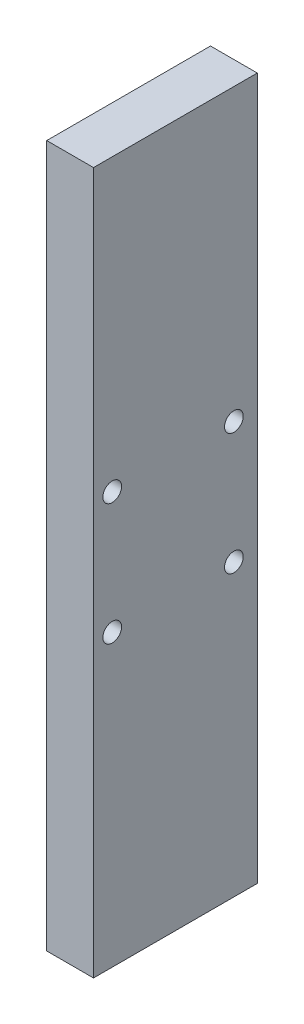
ISO-10303-21;
HEADER;
FILE_DESCRIPTION(('STEP AP214'),'2;1');
FILE_NAME('part.step','',(''),(''),'','','');
FILE_SCHEMA(('AUTOMOTIVE_DESIGN { 1 0 10303 214 1 1 1 1 }'));
ENDSEC;
DATA;
#1=APPLICATION_CONTEXT('core data for automotive mechanical design processes');
#2=APPLICATION_PROTOCOL_DEFINITION('international standard','automotive_design',2000,#1);
#3=PRODUCT_CONTEXT('',#1,'mechanical');
#4=PRODUCT('Part','Part','',(#3));
#5=PRODUCT_RELATED_PRODUCT_CATEGORY('part','',(#4));
#6=PRODUCT_DEFINITION_FORMATION('','',#4);
#7=PRODUCT_DEFINITION_CONTEXT('part definition',#1,'design');
#8=PRODUCT_DEFINITION('design','',#6,#7);
#9=PRODUCT_DEFINITION_SHAPE('','',#8);
#10=(LENGTH_UNIT() NAMED_UNIT(*) SI_UNIT(.MILLI.,.METRE.));
#11=(NAMED_UNIT(*) PLANE_ANGLE_UNIT() SI_UNIT($,.RADIAN.));
#12=(NAMED_UNIT(*) SI_UNIT($,.STERADIAN.) SOLID_ANGLE_UNIT());
#13=UNCERTAINTY_MEASURE_WITH_UNIT(LENGTH_MEASURE(1.E-05),#10,'distance_accuracy_value','');
#14=(GEOMETRIC_REPRESENTATION_CONTEXT(3) GLOBAL_UNCERTAINTY_ASSIGNED_CONTEXT((#13)) GLOBAL_UNIT_ASSIGNED_CONTEXT((#10,
#11,#12)) REPRESENTATION_CONTEXT('',''));
#15=CARTESIAN_POINT('',(0.,0.,0.));
#16=DIRECTION('',(0.,0.,1.));
#17=DIRECTION('',(1.,0.,0.));
#18=AXIS2_PLACEMENT_3D('',#15,#16,#17);
#19=CARTESIAN_POINT('',(10.,0.,0.));
#20=DIRECTION('',(0.,0.,-1.));
#21=DIRECTION('',(-1.,0.,0.));
#22=AXIS2_PLACEMENT_3D('',#19,#20,#21);
#23=PLANE('',#22);
#24=DIRECTION('',(0.,-1.,0.));
#25=VECTOR('',#24,1.);
#26=CARTESIAN_POINT('',(0.,0.,0.));
#27=LINE('',#26,#25);
#28=CARTESIAN_POINT('',(0.,150.,0.));
#29=VERTEX_POINT('',#28);
#30=CARTESIAN_POINT('',(0.,0.,0.));
#31=VERTEX_POINT('',#30);
#32=EDGE_CURVE('E182',#29,#31,#27,.T.);
#33=ORIENTED_EDGE('',*,*,#32,.T.);
#34=DIRECTION('',(-1.,0.,0.));
#35=VECTOR('',#34,1.);
#36=CARTESIAN_POINT('',(10.,0.,0.));
#37=LINE('',#36,#35);
#38=CARTESIAN_POINT('',(10.,0.,0.));
#39=VERTEX_POINT('',#38);
#40=EDGE_CURVE('E12',#39,#31,#37,.T.);
#41=ORIENTED_EDGE('',*,*,#40,.F.);
#42=DIRECTION('',(0.,-1.,0.));
#43=VECTOR('',#42,1.);
#44=CARTESIAN_POINT('',(10.,0.,0.));
#45=LINE('',#44,#43);
#46=CARTESIAN_POINT('',(10.,150.,0.));
#47=VERTEX_POINT('',#46);
#48=EDGE_CURVE('E102',#47,#39,#45,.T.);
#49=ORIENTED_EDGE('',*,*,#48,.F.);
#50=DIRECTION('',(-1.,0.,0.));
#51=VECTOR('',#50,1.);
#52=CARTESIAN_POINT('',(10.,150.,0.));
#53=LINE('',#52,#51);
#54=EDGE_CURVE('E115',#47,#29,#53,.T.);
#55=ORIENTED_EDGE('',*,*,#54,.T.);
#56=EDGE_LOOP('',(#33,#41,#49,#55));
#57=FACE_BOUND('',#56,.T.);
#58=ADVANCED_FACE('F49',(#57),#23,.F.);
#59=CARTESIAN_POINT('',(10.,0.,0.));
#60=DIRECTION('',(0.,1.,0.));
#61=DIRECTION('',(0.,0.,1.));
#62=AXIS2_PLACEMENT_3D('',#59,#60,#61);
#63=PLANE('',#62);
#64=DIRECTION('',(0.,0.,-1.));
#65=VECTOR('',#64,1.);
#66=CARTESIAN_POINT('',(0.,0.,0.));
#67=LINE('',#66,#65);
#68=CARTESIAN_POINT('',(0.,0.,-35.));
#69=VERTEX_POINT('',#68);
#70=EDGE_CURVE('E107',#31,#69,#67,.T.);
#71=ORIENTED_EDGE('',*,*,#70,.T.);
#72=DIRECTION('',(-1.,0.,0.));
#73=VECTOR('',#72,1.);
#74=CARTESIAN_POINT('',(10.,0.,-35.));
#75=LINE('',#74,#73);
#76=CARTESIAN_POINT('',(10.,0.,-35.));
#77=VERTEX_POINT('',#76);
#78=EDGE_CURVE('E59',#77,#69,#75,.T.);
#79=ORIENTED_EDGE('',*,*,#78,.F.);
#80=DIRECTION('',(0.,0.,-1.));
#81=VECTOR('',#80,1.);
#82=CARTESIAN_POINT('',(10.,0.,0.));
#83=LINE('',#82,#81);
#84=EDGE_CURVE('E97',#39,#77,#83,.T.);
#85=ORIENTED_EDGE('',*,*,#84,.F.);
#86=ORIENTED_EDGE('',*,*,#40,.T.);
#87=EDGE_LOOP('',(#71,#79,#85,#86));
#88=FACE_BOUND('',#87,.T.);
#89=ADVANCED_FACE('F106',(#88),#63,.F.);
#90=CARTESIAN_POINT('',(10.,0.,-35.));
#91=DIRECTION('',(0.,0.,1.));
#92=DIRECTION('',(1.,0.,0.));
#93=AXIS2_PLACEMENT_3D('',#90,#91,#92);
#94=PLANE('',#93);
#95=DIRECTION('',(0.,1.,0.));
#96=VECTOR('',#95,1.);
#97=CARTESIAN_POINT('',(0.,0.,-35.));
#98=LINE('',#97,#96);
#99=CARTESIAN_POINT('',(0.,150.,-35.));
#100=VERTEX_POINT('',#99);
#101=EDGE_CURVE('E84',#69,#100,#98,.T.);
#102=ORIENTED_EDGE('',*,*,#101,.T.);
#103=DIRECTION('',(-1.,0.,0.));
#104=VECTOR('',#103,1.);
#105=CARTESIAN_POINT('',(10.,150.,-35.));
#106=LINE('',#105,#104);
#107=CARTESIAN_POINT('',(10.,150.,-35.));
#108=VERTEX_POINT('',#107);
#109=EDGE_CURVE('E109',#108,#100,#106,.T.);
#110=ORIENTED_EDGE('',*,*,#109,.F.);
#111=DIRECTION('',(0.,1.,0.));
#112=VECTOR('',#111,1.);
#113=CARTESIAN_POINT('',(10.,0.,-35.));
#114=LINE('',#113,#112);
#115=EDGE_CURVE('E100',#77,#108,#114,.T.);
#116=ORIENTED_EDGE('',*,*,#115,.F.);
#117=ORIENTED_EDGE('',*,*,#78,.T.);
#118=EDGE_LOOP('',(#102,#110,#116,#117));
#119=FACE_BOUND('',#118,.T.);
#120=ADVANCED_FACE('F110',(#119),#94,.F.);
#121=CARTESIAN_POINT('',(10.,150.,0.));
#122=DIRECTION('',(0.,-1.,0.));
#123=DIRECTION('',(0.,0.,-1.));
#124=AXIS2_PLACEMENT_3D('',#121,#122,#123);
#125=PLANE('',#124);
#126=DIRECTION('',(0.,0.,1.));
#127=VECTOR('',#126,1.);
#128=CARTESIAN_POINT('',(0.,150.,0.));
#129=LINE('',#128,#127);
#130=EDGE_CURVE('E90',#100,#29,#129,.T.);
#131=ORIENTED_EDGE('',*,*,#130,.T.);
#132=ORIENTED_EDGE('',*,*,#54,.F.);
#133=DIRECTION('',(0.,0.,1.));
#134=VECTOR('',#133,1.);
#135=CARTESIAN_POINT('',(10.,150.,0.));
#136=LINE('',#135,#134);
#137=EDGE_CURVE('E67',#108,#47,#136,.T.);
#138=ORIENTED_EDGE('',*,*,#137,.F.);
#139=ORIENTED_EDGE('',*,*,#109,.T.);
#140=EDGE_LOOP('',(#131,#132,#138,#139));
#141=FACE_BOUND('',#140,.T.);
#142=ADVANCED_FACE('F238',(#141),#125,.F.);
#143=CARTESIAN_POINT('',(10.,0.,0.));
#144=DIRECTION('',(-1.,0.,0.));
#145=DIRECTION('',(0.,0.,1.));
#146=AXIS2_PLACEMENT_3D('',#143,#144,#145);
#147=PLANE('',#146);
#148=CARTESIAN_POINT('',(10.,62.,-4.00000000000001));
#149=DIRECTION('',(1.,0.,0.));
#150=DIRECTION('',(0.,0.,-1.));
#151=AXIS2_PLACEMENT_3D('',#148,#149,#150);
#152=CIRCLE('',#151,2.);
#153=CARTESIAN_POINT('',(10.,62.,-6.00000000000001));
#154=VERTEX_POINT('',#153);
#155=EDGE_CURVE('E170',#154,#154,#152,.T.);
#156=ORIENTED_EDGE('',*,*,#155,.F.);
#157=EDGE_LOOP('',(#156));
#158=FACE_BOUND('',#157,.T.);
#159=CARTESIAN_POINT('',(10.,62.,-30.));
#160=DIRECTION('',(1.,0.,0.));
#161=DIRECTION('',(0.,0.,-1.));
#162=AXIS2_PLACEMENT_3D('',#159,#160,#161);
#163=CIRCLE('',#162,2.);
#164=CARTESIAN_POINT('',(10.,62.,-32.));
#165=VERTEX_POINT('',#164);
#166=EDGE_CURVE('E211',#165,#165,#163,.T.);
#167=ORIENTED_EDGE('',*,*,#166,.F.);
#168=EDGE_LOOP('',(#167));
#169=FACE_BOUND('',#168,.T.);
#170=CARTESIAN_POINT('',(10.,88.,-30.));
#171=DIRECTION('',(1.,0.,0.));
#172=DIRECTION('',(0.,0.,-1.));
#173=AXIS2_PLACEMENT_3D('',#170,#171,#172);
#174=CIRCLE('',#173,2.);
#175=CARTESIAN_POINT('',(10.,88.,-32.));
#176=VERTEX_POINT('',#175);
#177=EDGE_CURVE('E200',#176,#176,#174,.T.);
#178=ORIENTED_EDGE('',*,*,#177,.F.);
#179=EDGE_LOOP('',(#178));
#180=FACE_BOUND('',#179,.T.);
#181=CARTESIAN_POINT('',(10.,88.,-4.00000000000001));
#182=DIRECTION('',(1.,0.,0.));
#183=DIRECTION('',(0.,0.,-1.));
#184=AXIS2_PLACEMENT_3D('',#181,#182,#183);
#185=CIRCLE('',#184,2.);
#186=CARTESIAN_POINT('',(10.,88.,-6.00000000000001));
#187=VERTEX_POINT('',#186);
#188=EDGE_CURVE('E137',#187,#187,#185,.T.);
#189=ORIENTED_EDGE('',*,*,#188,.F.);
#190=EDGE_LOOP('',(#189));
#191=FACE_BOUND('',#190,.T.);
#192=ORIENTED_EDGE('',*,*,#48,.T.);
#193=ORIENTED_EDGE('',*,*,#84,.T.);
#194=ORIENTED_EDGE('',*,*,#115,.T.);
#195=ORIENTED_EDGE('',*,*,#137,.T.);
#196=EDGE_LOOP('',(#192,#193,#194,#195));
#197=FACE_BOUND('',#196,.T.);
#198=ADVANCED_FACE('F98',(#158,#169,#180,#191,#197),#147,.F.);
#199=CARTESIAN_POINT('',(0.,0.,0.));
#200=DIRECTION('',(-1.,0.,0.));
#201=DIRECTION('',(0.,0.,1.));
#202=AXIS2_PLACEMENT_3D('',#199,#200,#201);
#203=PLANE('',#202);
#204=CARTESIAN_POINT('',(0.,62.,-4.00000000000001));
#205=DIRECTION('',(1.,0.,0.));
#206=DIRECTION('',(0.,0.,-1.));
#207=AXIS2_PLACEMENT_3D('',#204,#205,#206);
#208=CIRCLE('',#207,2.);
#209=CARTESIAN_POINT('',(0.,62.,-6.00000000000001));
#210=VERTEX_POINT('',#209);
#211=EDGE_CURVE('E174',#210,#210,#208,.T.);
#212=ORIENTED_EDGE('',*,*,#211,.T.);
#213=EDGE_LOOP('',(#212));
#214=FACE_BOUND('',#213,.T.);
#215=CARTESIAN_POINT('',(0.,62.,-30.));
#216=DIRECTION('',(1.,0.,0.));
#217=DIRECTION('',(0.,0.,-1.));
#218=AXIS2_PLACEMENT_3D('',#215,#216,#217);
#219=CIRCLE('',#218,2.);
#220=CARTESIAN_POINT('',(0.,62.,-32.));
#221=VERTEX_POINT('',#220);
#222=EDGE_CURVE('E207',#221,#221,#219,.T.);
#223=ORIENTED_EDGE('',*,*,#222,.T.);
#224=EDGE_LOOP('',(#223));
#225=FACE_BOUND('',#224,.T.);
#226=CARTESIAN_POINT('',(0.,88.,-30.));
#227=DIRECTION('',(1.,0.,0.));
#228=DIRECTION('',(0.,0.,-1.));
#229=AXIS2_PLACEMENT_3D('',#226,#227,#228);
#230=CIRCLE('',#229,2.);
#231=CARTESIAN_POINT('',(0.,88.,-32.));
#232=VERTEX_POINT('',#231);
#233=EDGE_CURVE('E196',#232,#232,#230,.T.);
#234=ORIENTED_EDGE('',*,*,#233,.T.);
#235=EDGE_LOOP('',(#234));
#236=FACE_BOUND('',#235,.T.);
#237=CARTESIAN_POINT('',(0.,88.,-4.00000000000001));
#238=DIRECTION('',(1.,0.,0.));
#239=DIRECTION('',(0.,0.,-1.));
#240=AXIS2_PLACEMENT_3D('',#237,#238,#239);
#241=CIRCLE('',#240,2.);
#242=CARTESIAN_POINT('',(0.,88.,-6.00000000000001));
#243=VERTEX_POINT('',#242);
#244=EDGE_CURVE('E177',#243,#243,#241,.T.);
#245=ORIENTED_EDGE('',*,*,#244,.T.);
#246=EDGE_LOOP('',(#245));
#247=FACE_BOUND('',#246,.T.);
#248=ORIENTED_EDGE('',*,*,#32,.F.);
#249=ORIENTED_EDGE('',*,*,#130,.F.);
#250=ORIENTED_EDGE('',*,*,#101,.F.);
#251=ORIENTED_EDGE('',*,*,#70,.F.);
#252=EDGE_LOOP('',(#248,#249,#250,#251));
#253=FACE_BOUND('',#252,.T.);
#254=ADVANCED_FACE('F226',(#214,#225,#236,#247,#253),#203,.T.);
#255=CARTESIAN_POINT('',(0.,88.,-4.00000000000001));
#256=DIRECTION('',(1.,0.,0.));
#257=DIRECTION('',(0.,0.,-1.));
#258=AXIS2_PLACEMENT_3D('',#255,#256,#257);
#259=CYLINDRICAL_SURFACE('',#258,2.);
#260=ORIENTED_EDGE('',*,*,#244,.F.);
#261=EDGE_LOOP('',(#260));
#262=FACE_BOUND('',#261,.T.);
#263=ORIENTED_EDGE('',*,*,#188,.T.);
#264=EDGE_LOOP('',(#263));
#265=FACE_BOUND('',#264,.T.);
#266=ADVANCED_FACE('F339',(#262,#265),#259,.F.);
#267=CARTESIAN_POINT('',(0.,88.,-30.));
#268=DIRECTION('',(1.,0.,0.));
#269=DIRECTION('',(0.,0.,-1.));
#270=AXIS2_PLACEMENT_3D('',#267,#268,#269);
#271=CYLINDRICAL_SURFACE('',#270,2.);
#272=ORIENTED_EDGE('',*,*,#233,.F.);
#273=EDGE_LOOP('',(#272));
#274=FACE_BOUND('',#273,.T.);
#275=ORIENTED_EDGE('',*,*,#177,.T.);
#276=EDGE_LOOP('',(#275));
#277=FACE_BOUND('',#276,.T.);
#278=ADVANCED_FACE('F344',(#274,#277),#271,.F.);
#279=CARTESIAN_POINT('',(0.,62.,-30.));
#280=DIRECTION('',(1.,0.,0.));
#281=DIRECTION('',(0.,0.,-1.));
#282=AXIS2_PLACEMENT_3D('',#279,#280,#281);
#283=CYLINDRICAL_SURFACE('',#282,2.);
#284=ORIENTED_EDGE('',*,*,#222,.F.);
#285=EDGE_LOOP('',(#284));
#286=FACE_BOUND('',#285,.T.);
#287=ORIENTED_EDGE('',*,*,#166,.T.);
#288=EDGE_LOOP('',(#287));
#289=FACE_BOUND('',#288,.T.);
#290=ADVANCED_FACE('F232',(#286,#289),#283,.F.);
#291=CARTESIAN_POINT('',(0.,62.,-4.00000000000001));
#292=DIRECTION('',(1.,0.,0.));
#293=DIRECTION('',(0.,0.,-1.));
#294=AXIS2_PLACEMENT_3D('',#291,#292,#293);
#295=CYLINDRICAL_SURFACE('',#294,2.);
#296=ORIENTED_EDGE('',*,*,#211,.F.);
#297=EDGE_LOOP('',(#296));
#298=FACE_BOUND('',#297,.T.);
#299=ORIENTED_EDGE('',*,*,#155,.T.);
#300=EDGE_LOOP('',(#299));
#301=FACE_BOUND('',#300,.T.);
#302=ADVANCED_FACE('F229',(#298,#301),#295,.F.);
#303=CLOSED_SHELL('',(#58,#89,#120,#142,#198,#254,#266,#278,#290,#302));
#304=MANIFOLD_SOLID_BREP('B2',#303);
#305=ADVANCED_BREP_SHAPE_REPRESENTATION('',(#18,#304),#14);
#306=SHAPE_DEFINITION_REPRESENTATION(#9,#305);
ENDSEC;
END-ISO-10303-21;
